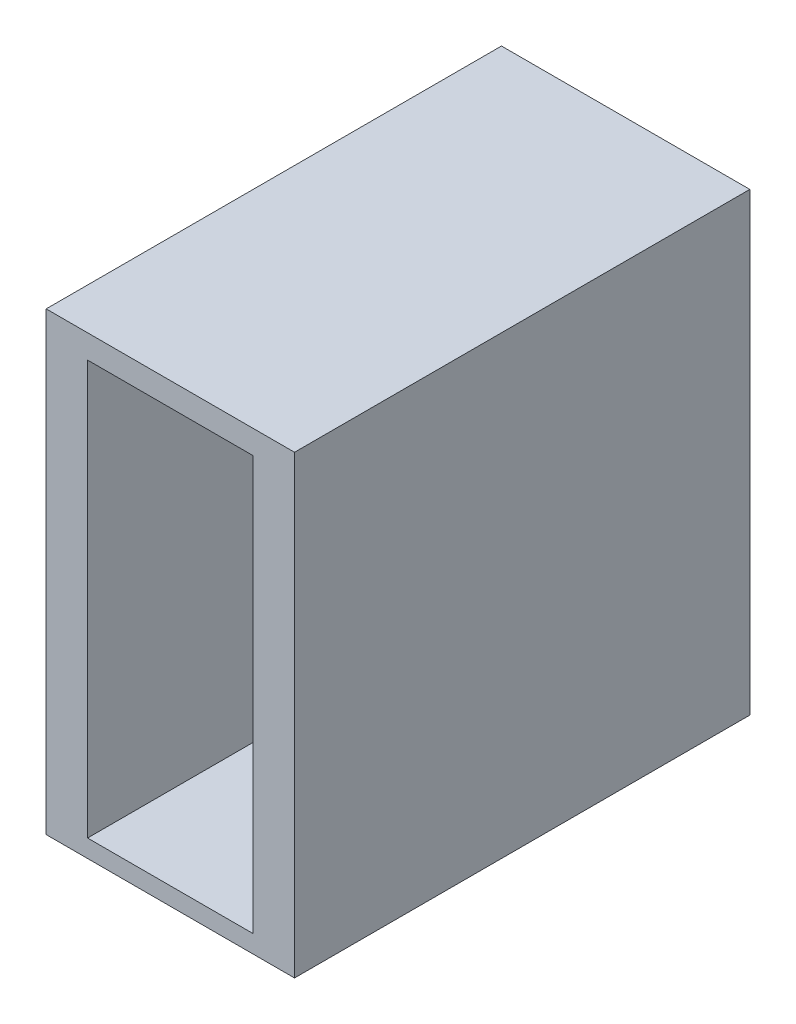
ISO-10303-21;
HEADER;
FILE_DESCRIPTION(('STEP AP214'),'2;1');
FILE_NAME('part.step','',(''),(''),'','','');
FILE_SCHEMA(('AUTOMOTIVE_DESIGN { 1 0 10303 214 1 1 1 1 }'));
ENDSEC;
DATA;
#1=APPLICATION_CONTEXT('core data for automotive mechanical design processes');
#2=APPLICATION_PROTOCOL_DEFINITION('international standard','automotive_design',2000,#1);
#3=PRODUCT_CONTEXT('',#1,'mechanical');
#4=PRODUCT('Part','Part','',(#3));
#5=PRODUCT_RELATED_PRODUCT_CATEGORY('part','',(#4));
#6=PRODUCT_DEFINITION_FORMATION('','',#4);
#7=PRODUCT_DEFINITION_CONTEXT('part definition',#1,'design');
#8=PRODUCT_DEFINITION('design','',#6,#7);
#9=PRODUCT_DEFINITION_SHAPE('','',#8);
#10=(LENGTH_UNIT() NAMED_UNIT(*) SI_UNIT(.MILLI.,.METRE.));
#11=(NAMED_UNIT(*) PLANE_ANGLE_UNIT() SI_UNIT($,.RADIAN.));
#12=(NAMED_UNIT(*) SI_UNIT($,.STERADIAN.) SOLID_ANGLE_UNIT());
#13=UNCERTAINTY_MEASURE_WITH_UNIT(LENGTH_MEASURE(1.E-05),#10,'distance_accuracy_value','');
#14=(GEOMETRIC_REPRESENTATION_CONTEXT(3) GLOBAL_UNCERTAINTY_ASSIGNED_CONTEXT((#13)) GLOBAL_UNIT_ASSIGNED_CONTEXT((#10,
#11,#12)) REPRESENTATION_CONTEXT('',''));
#15=CARTESIAN_POINT('',(0.,0.,0.));
#16=DIRECTION('',(0.,0.,1.));
#17=DIRECTION('',(1.,0.,0.));
#18=AXIS2_PLACEMENT_3D('',#15,#16,#17);
#19=CARTESIAN_POINT('',(0.,22.,0.));
#20=DIRECTION('',(1.,0.,0.));
#21=DIRECTION('',(0.,0.,-1.));
#22=AXIS2_PLACEMENT_3D('',#19,#20,#21);
#23=PLANE('',#22);
#24=DIRECTION('',(0.,0.,1.));
#25=VECTOR('',#24,1.);
#26=CARTESIAN_POINT('',(0.,0.,0.));
#27=LINE('',#26,#25);
#28=CARTESIAN_POINT('',(0.,0.,-22.));
#29=VERTEX_POINT('',#28);
#30=CARTESIAN_POINT('',(0.,0.,0.));
#31=VERTEX_POINT('',#30);
#32=EDGE_CURVE('E199',#29,#31,#27,.T.);
#33=ORIENTED_EDGE('',*,*,#32,.T.);
#34=DIRECTION('',(0.,-1.,0.));
#35=VECTOR('',#34,1.);
#36=CARTESIAN_POINT('',(0.,22.,0.));
#37=LINE('',#36,#35);
#38=CARTESIAN_POINT('',(0.,22.,0.));
#39=VERTEX_POINT('',#38);
#40=EDGE_CURVE('E246',#39,#31,#37,.T.);
#41=ORIENTED_EDGE('',*,*,#40,.F.);
#42=DIRECTION('',(0.,0.,1.));
#43=VECTOR('',#42,1.);
#44=CARTESIAN_POINT('',(0.,22.,0.));
#45=LINE('',#44,#43);
#46=CARTESIAN_POINT('',(0.,22.,-22.));
#47=VERTEX_POINT('',#46);
#48=EDGE_CURVE('E209',#47,#39,#45,.T.);
#49=ORIENTED_EDGE('',*,*,#48,.F.);
#50=DIRECTION('',(0.,-1.,0.));
#51=VECTOR('',#50,1.);
#52=CARTESIAN_POINT('',(0.,22.,-22.));
#53=LINE('',#52,#51);
#54=EDGE_CURVE('E223',#47,#29,#53,.T.);
#55=ORIENTED_EDGE('',*,*,#54,.T.);
#56=EDGE_LOOP('',(#33,#41,#49,#55));
#57=FACE_BOUND('',#56,.T.);
#58=ADVANCED_FACE('F39',(#57),#23,.F.);
#59=CARTESIAN_POINT('',(0.,22.,0.));
#60=DIRECTION('',(0.,0.,-1.));
#61=DIRECTION('',(-1.,0.,0.));
#62=AXIS2_PLACEMENT_3D('',#59,#60,#61);
#63=PLANE('',#62);
#64=DIRECTION('',(1.,0.,0.));
#65=VECTOR('',#64,1.);
#66=CARTESIAN_POINT('',(2.,0.857747020376852,0.));
#67=LINE('',#66,#65);
#68=CARTESIAN_POINT('',(2.,0.857747020376852,0.));
#69=VERTEX_POINT('',#68);
#70=CARTESIAN_POINT('',(10.,0.857747020376852,0.));
#71=VERTEX_POINT('',#70);
#72=EDGE_CURVE('E185',#69,#71,#67,.T.);
#73=ORIENTED_EDGE('',*,*,#72,.F.);
#74=DIRECTION('',(0.,-1.,0.));
#75=VECTOR('',#74,1.);
#76=CARTESIAN_POINT('',(2.,20.8577470203769,0.));
#77=LINE('',#76,#75);
#78=CARTESIAN_POINT('',(2.,20.8577470203769,0.));
#79=VERTEX_POINT('',#78);
#80=EDGE_CURVE('E159',#79,#69,#77,.T.);
#81=ORIENTED_EDGE('',*,*,#80,.F.);
#82=DIRECTION('',(-1.,0.,0.));
#83=VECTOR('',#82,1.);
#84=CARTESIAN_POINT('',(2.,20.8577470203769,0.));
#85=LINE('',#84,#83);
#86=CARTESIAN_POINT('',(10.,20.8577470203769,0.));
#87=VERTEX_POINT('',#86);
#88=EDGE_CURVE('E170',#87,#79,#85,.T.);
#89=ORIENTED_EDGE('',*,*,#88,.F.);
#90=DIRECTION('',(0.,1.,0.));
#91=VECTOR('',#90,1.);
#92=CARTESIAN_POINT('',(10.,20.8577470203769,0.));
#93=LINE('',#92,#91);
#94=EDGE_CURVE('E189',#71,#87,#93,.T.);
#95=ORIENTED_EDGE('',*,*,#94,.F.);
#96=EDGE_LOOP('',(#73,#81,#89,#95));
#97=FACE_BOUND('',#96,.T.);
#98=DIRECTION('',(1.,0.,0.));
#99=VECTOR('',#98,1.);
#100=CARTESIAN_POINT('',(0.,0.,0.));
#101=LINE('',#100,#99);
#102=CARTESIAN_POINT('',(12.,0.,0.));
#103=VERTEX_POINT('',#102);
#104=EDGE_CURVE('E227',#31,#103,#101,.T.);
#105=ORIENTED_EDGE('',*,*,#104,.T.);
#106=DIRECTION('',(0.,-1.,0.));
#107=VECTOR('',#106,1.);
#108=CARTESIAN_POINT('',(12.,22.,0.));
#109=LINE('',#108,#107);
#110=CARTESIAN_POINT('',(12.,22.,0.));
#111=VERTEX_POINT('',#110);
#112=EDGE_CURVE('E242',#111,#103,#109,.T.);
#113=ORIENTED_EDGE('',*,*,#112,.F.);
#114=DIRECTION('',(1.,0.,0.));
#115=VECTOR('',#114,1.);
#116=CARTESIAN_POINT('',(0.,22.,0.));
#117=LINE('',#116,#115);
#118=EDGE_CURVE('E213',#39,#111,#117,.T.);
#119=ORIENTED_EDGE('',*,*,#118,.F.);
#120=ORIENTED_EDGE('',*,*,#40,.T.);
#121=EDGE_LOOP('',(#105,#113,#119,#120));
#122=FACE_BOUND('',#121,.T.);
#123=ADVANCED_FACE('F272',(#97,#122),#63,.F.);
#124=CARTESIAN_POINT('',(12.,22.,0.));
#125=DIRECTION('',(-1.,0.,0.));
#126=DIRECTION('',(0.,0.,1.));
#127=AXIS2_PLACEMENT_3D('',#124,#125,#126);
#128=PLANE('',#127);
#129=DIRECTION('',(0.,0.,-1.));
#130=VECTOR('',#129,1.);
#131=CARTESIAN_POINT('',(12.,0.,0.));
#132=LINE('',#131,#130);
#133=CARTESIAN_POINT('',(12.,0.,-22.));
#134=VERTEX_POINT('',#133);
#135=EDGE_CURVE('E230',#103,#134,#132,.T.);
#136=ORIENTED_EDGE('',*,*,#135,.T.);
#137=DIRECTION('',(0.,-1.,0.));
#138=VECTOR('',#137,1.);
#139=CARTESIAN_POINT('',(12.,22.,-22.));
#140=LINE('',#139,#138);
#141=CARTESIAN_POINT('',(12.,22.,-22.));
#142=VERTEX_POINT('',#141);
#143=EDGE_CURVE('E238',#142,#134,#140,.T.);
#144=ORIENTED_EDGE('',*,*,#143,.F.);
#145=DIRECTION('',(0.,0.,-1.));
#146=VECTOR('',#145,1.);
#147=CARTESIAN_POINT('',(12.,22.,0.));
#148=LINE('',#147,#146);
#149=EDGE_CURVE('E217',#111,#142,#148,.T.);
#150=ORIENTED_EDGE('',*,*,#149,.F.);
#151=ORIENTED_EDGE('',*,*,#112,.T.);
#152=EDGE_LOOP('',(#136,#144,#150,#151));
#153=FACE_BOUND('',#152,.T.);
#154=ADVANCED_FACE('F277',(#153),#128,.F.);
#155=CARTESIAN_POINT('',(0.,22.,-22.));
#156=DIRECTION('',(0.,0.,1.));
#157=DIRECTION('',(1.,0.,0.));
#158=AXIS2_PLACEMENT_3D('',#155,#156,#157);
#159=PLANE('',#158);
#160=DIRECTION('',(0.,-1.,0.));
#161=VECTOR('',#160,1.);
#162=CARTESIAN_POINT('',(5.00000000000001,22.,-22.));
#163=LINE('',#162,#161);
#164=CARTESIAN_POINT('',(5.00000000000001,19.1577470203769,-22.));
#165=VERTEX_POINT('',#164);
#166=CARTESIAN_POINT('',(5.00000000000001,2.55774702037685,-22.));
#167=VERTEX_POINT('',#166);
#168=EDGE_CURVE('E47',#165,#167,#163,.T.);
#169=ORIENTED_EDGE('',*,*,#168,.T.);
#170=CARTESIAN_POINT('',(6.00000000000001,2.55774702037685,-22.));
#171=DIRECTION('',(0.,0.,1.));
#172=DIRECTION('',(1.,0.,0.));
#173=AXIS2_PLACEMENT_3D('',#170,#171,#172);
#174=CIRCLE('',#173,1.);
#175=CARTESIAN_POINT('',(7.00000000000001,2.55774702037685,-22.));
#176=VERTEX_POINT('',#175);
#177=EDGE_CURVE('E11',#167,#176,#174,.T.);
#178=ORIENTED_EDGE('',*,*,#177,.T.);
#179=DIRECTION('',(0.,1.,0.));
#180=VECTOR('',#179,1.);
#181=CARTESIAN_POINT('',(7.00000000000001,22.,-22.));
#182=LINE('',#181,#180);
#183=CARTESIAN_POINT('',(7.00000000000001,19.1577470203769,-22.));
#184=VERTEX_POINT('',#183);
#185=EDGE_CURVE('E133',#176,#184,#182,.T.);
#186=ORIENTED_EDGE('',*,*,#185,.T.);
#187=CARTESIAN_POINT('',(6.,19.1577470203769,-22.));
#188=DIRECTION('',(0.,0.,1.));
#189=DIRECTION('',(1.,0.,0.));
#190=AXIS2_PLACEMENT_3D('',#187,#188,#189);
#191=CIRCLE('',#190,1.);
#192=EDGE_CURVE('E252',#184,#165,#191,.T.);
#193=ORIENTED_EDGE('',*,*,#192,.T.);
#194=EDGE_LOOP('',(#169,#178,#186,#193));
#195=FACE_BOUND('',#194,.T.);
#196=DIRECTION('',(-1.,0.,0.));
#197=VECTOR('',#196,1.);
#198=CARTESIAN_POINT('',(0.,0.,-22.));
#199=LINE('',#198,#197);
#200=EDGE_CURVE('E214',#134,#29,#199,.T.);
#201=ORIENTED_EDGE('',*,*,#200,.T.);
#202=ORIENTED_EDGE('',*,*,#54,.F.);
#203=DIRECTION('',(-1.,0.,0.));
#204=VECTOR('',#203,1.);
#205=CARTESIAN_POINT('',(0.,22.,-22.));
#206=LINE('',#205,#204);
#207=EDGE_CURVE('E220',#142,#47,#206,.T.);
#208=ORIENTED_EDGE('',*,*,#207,.F.);
#209=ORIENTED_EDGE('',*,*,#143,.T.);
#210=EDGE_LOOP('',(#201,#202,#208,#209));
#211=FACE_BOUND('',#210,.T.);
#212=ADVANCED_FACE('F258',(#195,#211),#159,.F.);
#213=CARTESIAN_POINT('',(0.,22.,0.));
#214=DIRECTION('',(0.,-1.,0.));
#215=DIRECTION('',(0.,0.,-1.));
#216=AXIS2_PLACEMENT_3D('',#213,#214,#215);
#217=PLANE('',#216);
#218=ORIENTED_EDGE('',*,*,#48,.T.);
#219=ORIENTED_EDGE('',*,*,#118,.T.);
#220=ORIENTED_EDGE('',*,*,#149,.T.);
#221=ORIENTED_EDGE('',*,*,#207,.T.);
#222=EDGE_LOOP('',(#218,#219,#220,#221));
#223=FACE_BOUND('',#222,.T.);
#224=ADVANCED_FACE('F291',(#223),#217,.F.);
#225=CARTESIAN_POINT('',(0.,0.,0.));
#226=DIRECTION('',(0.,-1.,0.));
#227=DIRECTION('',(0.,0.,-1.));
#228=AXIS2_PLACEMENT_3D('',#225,#226,#227);
#229=PLANE('',#228);
#230=ORIENTED_EDGE('',*,*,#32,.F.);
#231=ORIENTED_EDGE('',*,*,#200,.F.);
#232=ORIENTED_EDGE('',*,*,#135,.F.);
#233=ORIENTED_EDGE('',*,*,#104,.F.);
#234=EDGE_LOOP('',(#230,#231,#232,#233));
#235=FACE_BOUND('',#234,.T.);
#236=ADVANCED_FACE('F285',(#235),#229,.T.);
#237=CARTESIAN_POINT('',(2.,20.8577470203769,-18.));
#238=DIRECTION('',(-1.,0.,0.));
#239=DIRECTION('',(0.,-1.,0.));
#240=AXIS2_PLACEMENT_3D('',#237,#238,#239);
#241=PLANE('',#240);
#242=ORIENTED_EDGE('',*,*,#80,.T.);
#243=DIRECTION('',(0.,0.,1.));
#244=VECTOR('',#243,1.);
#245=CARTESIAN_POINT('',(2.,0.857747020376852,-18.));
#246=LINE('',#245,#244);
#247=CARTESIAN_POINT('',(2.,0.857747020376852,-18.));
#248=VERTEX_POINT('',#247);
#249=EDGE_CURVE('E182',#248,#69,#246,.T.);
#250=ORIENTED_EDGE('',*,*,#249,.F.);
#251=DIRECTION('',(0.,-1.,0.));
#252=VECTOR('',#251,1.);
#253=CARTESIAN_POINT('',(2.,20.8577470203769,-18.));
#254=LINE('',#253,#252);
#255=CARTESIAN_POINT('',(2.,20.8577470203769,-18.));
#256=VERTEX_POINT('',#255);
#257=EDGE_CURVE('E165',#256,#248,#254,.T.);
#258=ORIENTED_EDGE('',*,*,#257,.F.);
#259=DIRECTION('',(0.,0.,1.));
#260=VECTOR('',#259,1.);
#261=CARTESIAN_POINT('',(2.,20.8577470203769,-18.));
#262=LINE('',#261,#260);
#263=EDGE_CURVE('E196',#256,#79,#262,.T.);
#264=ORIENTED_EDGE('',*,*,#263,.T.);
#265=EDGE_LOOP('',(#242,#250,#258,#264));
#266=FACE_BOUND('',#265,.T.);
#267=ADVANCED_FACE('F304',(#266),#241,.F.);
#268=CARTESIAN_POINT('',(2.,20.8577470203769,-18.));
#269=DIRECTION('',(0.,1.,0.));
#270=DIRECTION('',(0.,0.,1.));
#271=AXIS2_PLACEMENT_3D('',#268,#269,#270);
#272=PLANE('',#271);
#273=ORIENTED_EDGE('',*,*,#88,.T.);
#274=ORIENTED_EDGE('',*,*,#263,.F.);
#275=DIRECTION('',(-1.,0.,0.));
#276=VECTOR('',#275,1.);
#277=CARTESIAN_POINT('',(2.,20.8577470203769,-18.));
#278=LINE('',#277,#276);
#279=CARTESIAN_POINT('',(10.,20.8577470203769,-18.));
#280=VERTEX_POINT('',#279);
#281=EDGE_CURVE('E178',#280,#256,#278,.T.);
#282=ORIENTED_EDGE('',*,*,#281,.F.);
#283=DIRECTION('',(0.,0.,1.));
#284=VECTOR('',#283,1.);
#285=CARTESIAN_POINT('',(10.,20.8577470203769,-18.));
#286=LINE('',#285,#284);
#287=EDGE_CURVE('E200',#280,#87,#286,.T.);
#288=ORIENTED_EDGE('',*,*,#287,.T.);
#289=EDGE_LOOP('',(#273,#274,#282,#288));
#290=FACE_BOUND('',#289,.T.);
#291=ADVANCED_FACE('F309',(#290),#272,.F.);
#292=CARTESIAN_POINT('',(10.,20.8577470203769,-18.));
#293=DIRECTION('',(1.,0.,0.));
#294=DIRECTION('',(0.,1.,0.));
#295=AXIS2_PLACEMENT_3D('',#292,#293,#294);
#296=PLANE('',#295);
#297=ORIENTED_EDGE('',*,*,#94,.T.);
#298=ORIENTED_EDGE('',*,*,#287,.F.);
#299=DIRECTION('',(0.,1.,0.));
#300=VECTOR('',#299,1.);
#301=CARTESIAN_POINT('',(10.,20.8577470203769,-18.));
#302=LINE('',#301,#300);
#303=CARTESIAN_POINT('',(10.,0.857747020376852,-18.));
#304=VERTEX_POINT('',#303);
#305=EDGE_CURVE('E174',#304,#280,#302,.T.);
#306=ORIENTED_EDGE('',*,*,#305,.F.);
#307=DIRECTION('',(0.,0.,1.));
#308=VECTOR('',#307,1.);
#309=CARTESIAN_POINT('',(10.,0.857747020376852,-18.));
#310=LINE('',#309,#308);
#311=EDGE_CURVE('E203',#304,#71,#310,.T.);
#312=ORIENTED_EDGE('',*,*,#311,.T.);
#313=EDGE_LOOP('',(#297,#298,#306,#312));
#314=FACE_BOUND('',#313,.T.);
#315=ADVANCED_FACE('F314',(#314),#296,.F.);
#316=CARTESIAN_POINT('',(2.,0.857747020376852,-18.));
#317=DIRECTION('',(0.,-1.,0.));
#318=DIRECTION('',(1.,0.,0.));
#319=AXIS2_PLACEMENT_3D('',#316,#317,#318);
#320=PLANE('',#319);
#321=ORIENTED_EDGE('',*,*,#72,.T.);
#322=ORIENTED_EDGE('',*,*,#311,.F.);
#323=DIRECTION('',(1.,0.,0.));
#324=VECTOR('',#323,1.);
#325=CARTESIAN_POINT('',(2.,0.857747020376852,-18.));
#326=LINE('',#325,#324);
#327=EDGE_CURVE('E169',#248,#304,#326,.T.);
#328=ORIENTED_EDGE('',*,*,#327,.F.);
#329=ORIENTED_EDGE('',*,*,#249,.T.);
#330=EDGE_LOOP('',(#321,#322,#328,#329));
#331=FACE_BOUND('',#330,.T.);
#332=ADVANCED_FACE('F311',(#331),#320,.F.);
#333=CARTESIAN_POINT('',(0.,0.,-18.));
#334=DIRECTION('',(0.,0.,1.));
#335=DIRECTION('',(1.,0.,0.));
#336=AXIS2_PLACEMENT_3D('',#333,#334,#335);
#337=PLANE('',#336);
#338=CARTESIAN_POINT('',(6.00000000000001,2.55774702037685,-18.));
#339=DIRECTION('',(0.,0.,1.));
#340=DIRECTION('',(1.,0.,0.));
#341=AXIS2_PLACEMENT_3D('',#338,#339,#340);
#342=CIRCLE('',#341,1.);
#343=CARTESIAN_POINT('',(5.00000000000001,2.55774702037685,-18.));
#344=VERTEX_POINT('',#343);
#345=CARTESIAN_POINT('',(7.00000000000001,2.55774702037685,-18.));
#346=VERTEX_POINT('',#345);
#347=EDGE_CURVE('E139',#344,#346,#342,.T.);
#348=ORIENTED_EDGE('',*,*,#347,.F.);
#349=DIRECTION('',(0.,-1.,0.));
#350=VECTOR('',#349,1.);
#351=CARTESIAN_POINT('',(5.00000000000001,2.55774702037685,-18.));
#352=LINE('',#351,#350);
#353=CARTESIAN_POINT('',(5.00000000000001,19.1577470203769,-18.));
#354=VERTEX_POINT('',#353);
#355=EDGE_CURVE('E136',#354,#344,#352,.T.);
#356=ORIENTED_EDGE('',*,*,#355,.F.);
#357=CARTESIAN_POINT('',(6.,19.1577470203769,-18.));
#358=DIRECTION('',(0.,0.,1.));
#359=DIRECTION('',(1.,0.,0.));
#360=AXIS2_PLACEMENT_3D('',#357,#358,#359);
#361=CIRCLE('',#360,1.);
#362=CARTESIAN_POINT('',(7.,19.1577470203769,-18.));
#363=VERTEX_POINT('',#362);
#364=EDGE_CURVE('E54',#363,#354,#361,.T.);
#365=ORIENTED_EDGE('',*,*,#364,.F.);
#366=DIRECTION('',(0.,1.,0.));
#367=VECTOR('',#366,1.);
#368=CARTESIAN_POINT('',(7.00000000000001,2.55774702037685,-18.));
#369=LINE('',#368,#367);
#370=EDGE_CURVE('E131',#346,#363,#369,.T.);
#371=ORIENTED_EDGE('',*,*,#370,.F.);
#372=EDGE_LOOP('',(#348,#356,#365,#371));
#373=FACE_BOUND('',#372,.T.);
#374=ORIENTED_EDGE('',*,*,#257,.T.);
#375=ORIENTED_EDGE('',*,*,#327,.T.);
#376=ORIENTED_EDGE('',*,*,#305,.T.);
#377=ORIENTED_EDGE('',*,*,#281,.T.);
#378=EDGE_LOOP('',(#374,#375,#376,#377));
#379=FACE_BOUND('',#378,.T.);
#380=ADVANCED_FACE('F148',(#373,#379),#337,.T.);
#381=CARTESIAN_POINT('',(6.00000000000001,2.55774702037685,-28.));
#382=DIRECTION('',(0.,0.,1.));
#383=DIRECTION('',(1.,0.,0.));
#384=AXIS2_PLACEMENT_3D('',#381,#382,#383);
#385=CYLINDRICAL_SURFACE('',#384,1.);
#386=DIRECTION('',(0.,0.,1.));
#387=VECTOR('',#386,1.);
#388=CARTESIAN_POINT('',(5.00000000000001,2.55774702037685,-28.));
#389=LINE('',#388,#387);
#390=EDGE_CURVE('E142',#167,#344,#389,.T.);
#391=ORIENTED_EDGE('',*,*,#390,.T.);
#392=ORIENTED_EDGE('',*,*,#347,.T.);
#393=DIRECTION('',(0.,0.,1.));
#394=VECTOR('',#393,1.);
#395=CARTESIAN_POINT('',(7.00000000000001,2.55774702037685,-28.));
#396=LINE('',#395,#394);
#397=EDGE_CURVE('E127',#176,#346,#396,.T.);
#398=ORIENTED_EDGE('',*,*,#397,.F.);
#399=ORIENTED_EDGE('',*,*,#177,.F.);
#400=EDGE_LOOP('',(#391,#392,#398,#399));
#401=FACE_BOUND('',#400,.T.);
#402=ADVANCED_FACE('F140',(#401),#385,.F.);
#403=CARTESIAN_POINT('',(5.00000000000001,2.55774702037685,-28.));
#404=DIRECTION('',(-1.,0.,0.));
#405=DIRECTION('',(0.,0.,1.));
#406=AXIS2_PLACEMENT_3D('',#403,#404,#405);
#407=PLANE('',#406);
#408=DIRECTION('',(0.,0.,1.));
#409=VECTOR('',#408,1.);
#410=CARTESIAN_POINT('',(5.00000000000001,19.1577470203769,-28.));
#411=LINE('',#410,#409);
#412=EDGE_CURVE('E160',#165,#354,#411,.T.);
#413=ORIENTED_EDGE('',*,*,#412,.T.);
#414=ORIENTED_EDGE('',*,*,#355,.T.);
#415=ORIENTED_EDGE('',*,*,#390,.F.);
#416=ORIENTED_EDGE('',*,*,#168,.F.);
#417=EDGE_LOOP('',(#413,#414,#415,#416));
#418=FACE_BOUND('',#417,.T.);
#419=ADVANCED_FACE('F261',(#418),#407,.F.);
#420=CARTESIAN_POINT('',(6.,19.1577470203769,-28.));
#421=DIRECTION('',(0.,0.,1.));
#422=DIRECTION('',(1.,0.,0.));
#423=AXIS2_PLACEMENT_3D('',#420,#421,#422);
#424=CYLINDRICAL_SURFACE('',#423,1.);
#425=DIRECTION('',(0.,0.,1.));
#426=VECTOR('',#425,1.);
#427=CARTESIAN_POINT('',(7.,19.1577470203769,-28.));
#428=LINE('',#427,#426);
#429=EDGE_CURVE('E61',#184,#363,#428,.T.);
#430=ORIENTED_EDGE('',*,*,#429,.T.);
#431=ORIENTED_EDGE('',*,*,#364,.T.);
#432=ORIENTED_EDGE('',*,*,#412,.F.);
#433=ORIENTED_EDGE('',*,*,#192,.F.);
#434=EDGE_LOOP('',(#430,#431,#432,#433));
#435=FACE_BOUND('',#434,.T.);
#436=ADVANCED_FACE('F262',(#435),#424,.F.);
#437=CARTESIAN_POINT('',(7.00000000000001,2.55774702037685,-28.));
#438=DIRECTION('',(1.,0.,0.));
#439=DIRECTION('',(0.,0.,-1.));
#440=AXIS2_PLACEMENT_3D('',#437,#438,#439);
#441=PLANE('',#440);
#442=ORIENTED_EDGE('',*,*,#397,.T.);
#443=ORIENTED_EDGE('',*,*,#370,.T.);
#444=ORIENTED_EDGE('',*,*,#429,.F.);
#445=ORIENTED_EDGE('',*,*,#185,.F.);
#446=EDGE_LOOP('',(#442,#443,#444,#445));
#447=FACE_BOUND('',#446,.T.);
#448=ADVANCED_FACE('F129',(#447),#441,.F.);
#449=CLOSED_SHELL('',(#58,#123,#154,#212,#224,#236,#267,#291,#315,#332,#380,#402,#419,#436,#448));
#450=MANIFOLD_SOLID_BREP('B2',#449);
#451=ADVANCED_BREP_SHAPE_REPRESENTATION('',(#18,#450),#14);
#452=SHAPE_DEFINITION_REPRESENTATION(#9,#451);
ENDSEC;
END-ISO-10303-21;
